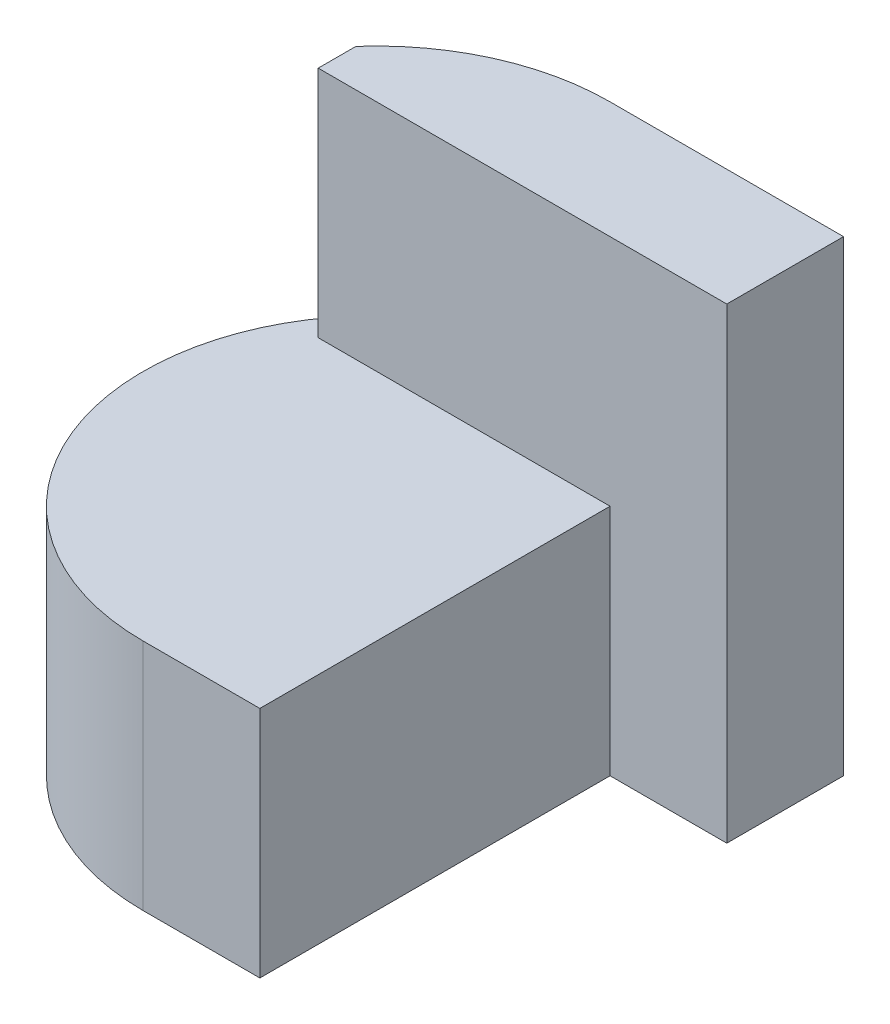
ISO-10303-21;
HEADER;
FILE_DESCRIPTION(('STEP AP214'),'2;1');
FILE_NAME('part.step','',(''),(''),'','','');
FILE_SCHEMA(('AUTOMOTIVE_DESIGN { 1 0 10303 214 1 1 1 1 }'));
ENDSEC;
DATA;
#1=APPLICATION_CONTEXT('core data for automotive mechanical design processes');
#2=APPLICATION_PROTOCOL_DEFINITION('international standard','automotive_design',2000,#1);
#3=PRODUCT_CONTEXT('',#1,'mechanical');
#4=PRODUCT('Part','Part','',(#3));
#5=PRODUCT_RELATED_PRODUCT_CATEGORY('part','',(#4));
#6=PRODUCT_DEFINITION_FORMATION('','',#4);
#7=PRODUCT_DEFINITION_CONTEXT('part definition',#1,'design');
#8=PRODUCT_DEFINITION('design','',#6,#7);
#9=PRODUCT_DEFINITION_SHAPE('','',#8);
#10=(LENGTH_UNIT() NAMED_UNIT(*) SI_UNIT(.MILLI.,.METRE.));
#11=(NAMED_UNIT(*) PLANE_ANGLE_UNIT() SI_UNIT($,.RADIAN.));
#12=(NAMED_UNIT(*) SI_UNIT($,.STERADIAN.) SOLID_ANGLE_UNIT());
#13=UNCERTAINTY_MEASURE_WITH_UNIT(LENGTH_MEASURE(1.E-05),#10,'distance_accuracy_value','');
#14=(GEOMETRIC_REPRESENTATION_CONTEXT(3) GLOBAL_UNCERTAINTY_ASSIGNED_CONTEXT((#13)) GLOBAL_UNIT_ASSIGNED_CONTEXT((#10,
#11,#12)) REPRESENTATION_CONTEXT('',''));
#15=CARTESIAN_POINT('',(0.,0.,0.));
#16=DIRECTION('',(0.,0.,1.));
#17=DIRECTION('',(1.,0.,0.));
#18=AXIS2_PLACEMENT_3D('',#15,#16,#17);
#19=CARTESIAN_POINT('',(0.,0.,40.));
#20=DIRECTION('',(0.,0.,-1.));
#21=DIRECTION('',(-1.,0.,0.));
#22=AXIS2_PLACEMENT_3D('',#19,#20,#21);
#23=PLANE('',#22);
#24=DIRECTION('',(0.,1.,0.));
#25=VECTOR('',#24,1.);
#26=CARTESIAN_POINT('',(30.,0.,40.));
#27=LINE('',#26,#25);
#28=CARTESIAN_POINT('',(30.,0.,40.));
#29=VERTEX_POINT('',#28);
#30=CARTESIAN_POINT('',(30.,20.,40.));
#31=VERTEX_POINT('',#30);
#32=EDGE_CURVE('E126',#29,#31,#27,.T.);
#33=ORIENTED_EDGE('',*,*,#32,.T.);
#34=DIRECTION('',(1.,0.,0.));
#35=VECTOR('',#34,1.);
#36=CARTESIAN_POINT('',(-10.,20.,40.));
#37=LINE('',#36,#35);
#38=CARTESIAN_POINT('',(20.,20.,40.));
#39=VERTEX_POINT('',#38);
#40=EDGE_CURVE('E114',#39,#31,#37,.T.);
#41=ORIENTED_EDGE('',*,*,#40,.F.);
#42=DIRECTION('',(0.,-1.,0.));
#43=VECTOR('',#42,1.);
#44=CARTESIAN_POINT('',(20.,40.,40.));
#45=LINE('',#44,#43);
#46=CARTESIAN_POINT('',(20.,0.,40.));
#47=VERTEX_POINT('',#46);
#48=EDGE_CURVE('E133',#39,#47,#45,.T.);
#49=ORIENTED_EDGE('',*,*,#48,.T.);
#50=DIRECTION('',(1.,0.,0.));
#51=VECTOR('',#50,1.);
#52=CARTESIAN_POINT('',(0.,0.,40.));
#53=LINE('',#52,#51);
#54=EDGE_CURVE('E132',#47,#29,#53,.T.);
#55=ORIENTED_EDGE('',*,*,#54,.T.);
#56=EDGE_LOOP('',(#33,#41,#49,#55));
#57=FACE_BOUND('',#56,.T.);
#58=ADVANCED_FACE('F51',(#57),#23,.F.);
#59=CARTESIAN_POINT('',(0.,0.,0.));
#60=DIRECTION('',(0.,0.,-1.));
#61=DIRECTION('',(-1.,0.,0.));
#62=AXIS2_PLACEMENT_3D('',#59,#60,#61);
#63=PLANE('',#62);
#64=DIRECTION('',(1.,0.,0.));
#65=VECTOR('',#64,1.);
#66=CARTESIAN_POINT('',(0.,0.,0.));
#67=LINE('',#66,#65);
#68=CARTESIAN_POINT('',(20.,0.,0.));
#69=VERTEX_POINT('',#68);
#70=CARTESIAN_POINT('',(40.,0.,0.));
#71=VERTEX_POINT('',#70);
#72=EDGE_CURVE('E158',#69,#71,#67,.T.);
#73=ORIENTED_EDGE('',*,*,#72,.F.);
#74=DIRECTION('',(0.,-1.,0.));
#75=VECTOR('',#74,1.);
#76=CARTESIAN_POINT('',(20.,40.,0.));
#77=LINE('',#76,#75);
#78=CARTESIAN_POINT('',(20.,40.,0.));
#79=VERTEX_POINT('',#78);
#80=EDGE_CURVE('E147',#79,#69,#77,.T.);
#81=ORIENTED_EDGE('',*,*,#80,.F.);
#82=DIRECTION('',(-1.,0.,0.));
#83=VECTOR('',#82,1.);
#84=CARTESIAN_POINT('',(0.,40.,0.));
#85=LINE('',#84,#83);
#86=CARTESIAN_POINT('',(40.,40.,0.));
#87=VERTEX_POINT('',#86);
#88=EDGE_CURVE('E163',#87,#79,#85,.T.);
#89=ORIENTED_EDGE('',*,*,#88,.F.);
#90=DIRECTION('',(0.,1.,0.));
#91=VECTOR('',#90,1.);
#92=CARTESIAN_POINT('',(40.,0.,0.));
#93=LINE('',#92,#91);
#94=EDGE_CURVE('E166',#71,#87,#93,.T.);
#95=ORIENTED_EDGE('',*,*,#94,.F.);
#96=EDGE_LOOP('',(#73,#81,#89,#95));
#97=FACE_BOUND('',#96,.T.);
#98=ADVANCED_FACE('F183',(#97),#63,.T.);
#99=CARTESIAN_POINT('',(0.,0.,40.));
#100=DIRECTION('',(0.,1.,0.));
#101=DIRECTION('',(0.,0.,1.));
#102=AXIS2_PLACEMENT_3D('',#99,#100,#101);
#103=PLANE('',#102);
#104=DIRECTION('',(-1.,0.,0.));
#105=VECTOR('',#104,1.);
#106=CARTESIAN_POINT('',(40.,0.,10.));
#107=LINE('',#106,#105);
#108=CARTESIAN_POINT('',(40.,0.,10.));
#109=VERTEX_POINT('',#108);
#110=CARTESIAN_POINT('',(30.,0.,10.));
#111=VERTEX_POINT('',#110);
#112=EDGE_CURVE('E188',#109,#111,#107,.T.);
#113=ORIENTED_EDGE('',*,*,#112,.T.);
#114=DIRECTION('',(0.,0.,1.));
#115=VECTOR('',#114,1.);
#116=CARTESIAN_POINT('',(30.,0.,40.));
#117=LINE('',#116,#115);
#118=EDGE_CURVE('E142',#111,#29,#117,.T.);
#119=ORIENTED_EDGE('',*,*,#118,.T.);
#120=ORIENTED_EDGE('',*,*,#54,.F.);
#121=CARTESIAN_POINT('',(20.,0.,20.));
#122=DIRECTION('',(0.,1.,0.));
#123=DIRECTION('',(0.,0.,1.));
#124=AXIS2_PLACEMENT_3D('',#121,#122,#123);
#125=CIRCLE('',#124,20.);
#126=EDGE_CURVE('E135',#69,#47,#125,.T.);
#127=ORIENTED_EDGE('',*,*,#126,.F.);
#128=ORIENTED_EDGE('',*,*,#72,.T.);
#129=DIRECTION('',(0.,0.,-1.));
#130=VECTOR('',#129,1.);
#131=CARTESIAN_POINT('',(40.,0.,40.));
#132=LINE('',#131,#130);
#133=EDGE_CURVE('E59',#109,#71,#132,.T.);
#134=ORIENTED_EDGE('',*,*,#133,.F.);
#135=EDGE_LOOP('',(#113,#119,#120,#127,#128,#134));
#136=FACE_BOUND('',#135,.T.);
#137=ADVANCED_FACE('F53',(#136),#103,.F.);
#138=CARTESIAN_POINT('',(40.,0.,40.));
#139=DIRECTION('',(-1.,0.,0.));
#140=DIRECTION('',(0.,0.,1.));
#141=AXIS2_PLACEMENT_3D('',#138,#139,#140);
#142=PLANE('',#141);
#143=DIRECTION('',(0.,0.,-1.));
#144=VECTOR('',#143,1.);
#145=CARTESIAN_POINT('',(40.,40.,40.));
#146=LINE('',#145,#144);
#147=CARTESIAN_POINT('',(40.,40.,10.));
#148=VERTEX_POINT('',#147);
#149=EDGE_CURVE('E162',#148,#87,#146,.T.);
#150=ORIENTED_EDGE('',*,*,#149,.F.);
#151=DIRECTION('',(0.,1.,0.));
#152=VECTOR('',#151,1.);
#153=CARTESIAN_POINT('',(40.,0.,10.));
#154=LINE('',#153,#152);
#155=EDGE_CURVE('E74',#109,#148,#154,.T.);
#156=ORIENTED_EDGE('',*,*,#155,.F.);
#157=ORIENTED_EDGE('',*,*,#133,.T.);
#158=ORIENTED_EDGE('',*,*,#94,.T.);
#159=EDGE_LOOP('',(#150,#156,#157,#158));
#160=FACE_BOUND('',#159,.T.);
#161=ADVANCED_FACE('F174',(#160),#142,.F.);
#162=CARTESIAN_POINT('',(0.,40.,40.));
#163=DIRECTION('',(0.,-1.,0.));
#164=DIRECTION('',(0.,0.,-1.));
#165=AXIS2_PLACEMENT_3D('',#162,#163,#164);
#166=PLANE('',#165);
#167=DIRECTION('',(0.,0.,1.));
#168=VECTOR('',#167,1.);
#169=CARTESIAN_POINT('',(5.,40.,0.));
#170=LINE('',#169,#168);
#171=CARTESIAN_POINT('',(5.,40.,6.77124344467705));
#172=VERTEX_POINT('',#171);
#173=CARTESIAN_POINT('',(5.,40.,10.));
#174=VERTEX_POINT('',#173);
#175=EDGE_CURVE('E155',#172,#174,#170,.T.);
#176=ORIENTED_EDGE('',*,*,#175,.T.);
#177=DIRECTION('',(-1.,0.,0.));
#178=VECTOR('',#177,1.);
#179=CARTESIAN_POINT('',(40.,40.,10.));
#180=LINE('',#179,#178);
#181=EDGE_CURVE('E139',#148,#174,#180,.T.);
#182=ORIENTED_EDGE('',*,*,#181,.F.);
#183=ORIENTED_EDGE('',*,*,#149,.T.);
#184=ORIENTED_EDGE('',*,*,#88,.T.);
#185=CARTESIAN_POINT('',(20.,40.,20.));
#186=DIRECTION('',(0.,1.,0.));
#187=DIRECTION('',(0.,0.,1.));
#188=AXIS2_PLACEMENT_3D('',#185,#186,#187);
#189=CIRCLE('',#188,20.);
#190=EDGE_CURVE('E144',#79,#172,#189,.T.);
#191=ORIENTED_EDGE('',*,*,#190,.T.);
#192=EDGE_LOOP('',(#176,#182,#183,#184,#191));
#193=FACE_BOUND('',#192,.T.);
#194=ADVANCED_FACE('F185',(#193),#166,.F.);
#195=CARTESIAN_POINT('',(5.,40.,0.));
#196=DIRECTION('',(1.,0.,0.));
#197=DIRECTION('',(0.,1.,0.));
#198=AXIS2_PLACEMENT_3D('',#195,#196,#197);
#199=PLANE('',#198);
#200=DIRECTION('',(0.,0.,1.));
#201=VECTOR('',#200,1.);
#202=CARTESIAN_POINT('',(5.,20.,0.));
#203=LINE('',#202,#201);
#204=CARTESIAN_POINT('',(5.,20.,6.77124344467705));
#205=VERTEX_POINT('',#204);
#206=CARTESIAN_POINT('',(5.,20.,10.));
#207=VERTEX_POINT('',#206);
#208=EDGE_CURVE('E154',#205,#207,#203,.T.);
#209=ORIENTED_EDGE('',*,*,#208,.T.);
#210=DIRECTION('',(0.,1.,0.));
#211=VECTOR('',#210,1.);
#212=CARTESIAN_POINT('',(5.,40.,10.));
#213=LINE('',#212,#211);
#214=EDGE_CURVE('E189',#207,#174,#213,.T.);
#215=ORIENTED_EDGE('',*,*,#214,.T.);
#216=ORIENTED_EDGE('',*,*,#175,.F.);
#217=DIRECTION('',(0.,-1.,0.));
#218=VECTOR('',#217,1.);
#219=CARTESIAN_POINT('',(5.,40.,6.77124344467705));
#220=LINE('',#219,#218);
#221=EDGE_CURVE('E151',#172,#205,#220,.T.);
#222=ORIENTED_EDGE('',*,*,#221,.T.);
#223=EDGE_LOOP('',(#209,#215,#216,#222));
#224=FACE_BOUND('',#223,.T.);
#225=ADVANCED_FACE('F195',(#224),#199,.F.);
#226=CARTESIAN_POINT('',(0.,20.,0.));
#227=DIRECTION('',(0.,-1.,0.));
#228=DIRECTION('',(0.,0.,-1.));
#229=AXIS2_PLACEMENT_3D('',#226,#227,#228);
#230=PLANE('',#229);
#231=CARTESIAN_POINT('',(20.,20.,20.));
#232=DIRECTION('',(0.,-1.,0.));
#233=DIRECTION('',(0.,0.,-1.));
#234=AXIS2_PLACEMENT_3D('',#231,#232,#233);
#235=CIRCLE('',#234,20.);
#236=EDGE_CURVE('E12',#205,#39,#235,.F.);
#237=ORIENTED_EDGE('',*,*,#236,.T.);
#238=ORIENTED_EDGE('',*,*,#40,.T.);
#239=DIRECTION('',(0.,0.,-1.));
#240=VECTOR('',#239,1.);
#241=CARTESIAN_POINT('',(30.,20.,40.));
#242=LINE('',#241,#240);
#243=CARTESIAN_POINT('',(30.,20.,10.));
#244=VERTEX_POINT('',#243);
#245=EDGE_CURVE('E66',#31,#244,#242,.T.);
#246=ORIENTED_EDGE('',*,*,#245,.T.);
#247=DIRECTION('',(1.,0.,0.));
#248=VECTOR('',#247,1.);
#249=CARTESIAN_POINT('',(-10.,20.,10.));
#250=LINE('',#249,#248);
#251=EDGE_CURVE('E120',#207,#244,#250,.T.);
#252=ORIENTED_EDGE('',*,*,#251,.F.);
#253=ORIENTED_EDGE('',*,*,#208,.F.);
#254=EDGE_LOOP('',(#237,#238,#246,#252,#253));
#255=FACE_BOUND('',#254,.T.);
#256=ADVANCED_FACE('F115',(#255),#230,.F.);
#257=CARTESIAN_POINT('',(20.,40.,20.));
#258=DIRECTION('',(0.,-1.,0.));
#259=DIRECTION('',(0.,0.,-1.));
#260=AXIS2_PLACEMENT_3D('',#257,#258,#259);
#261=CYLINDRICAL_SURFACE('',#260,20.);
#262=ORIENTED_EDGE('',*,*,#48,.F.);
#263=ORIENTED_EDGE('',*,*,#236,.F.);
#264=ORIENTED_EDGE('',*,*,#221,.F.);
#265=ORIENTED_EDGE('',*,*,#190,.F.);
#266=ORIENTED_EDGE('',*,*,#80,.T.);
#267=ORIENTED_EDGE('',*,*,#126,.T.);
#268=EDGE_LOOP('',(#262,#263,#264,#265,#266,#267));
#269=FACE_BOUND('',#268,.T.);
#270=ADVANCED_FACE('F197',(#269),#261,.T.);
#271=CARTESIAN_POINT('',(30.,0.,40.));
#272=DIRECTION('',(-1.,0.,0.));
#273=DIRECTION('',(0.,0.,1.));
#274=AXIS2_PLACEMENT_3D('',#271,#272,#273);
#275=PLANE('',#274);
#276=DIRECTION('',(0.,1.,0.));
#277=VECTOR('',#276,1.);
#278=CARTESIAN_POINT('',(30.,0.,10.));
#279=LINE('',#278,#277);
#280=EDGE_CURVE('E128',#111,#244,#279,.T.);
#281=ORIENTED_EDGE('',*,*,#280,.T.);
#282=ORIENTED_EDGE('',*,*,#245,.F.);
#283=ORIENTED_EDGE('',*,*,#32,.F.);
#284=ORIENTED_EDGE('',*,*,#118,.F.);
#285=EDGE_LOOP('',(#281,#282,#283,#284));
#286=FACE_BOUND('',#285,.T.);
#287=ADVANCED_FACE('F124',(#286),#275,.F.);
#288=CARTESIAN_POINT('',(40.,0.,10.));
#289=DIRECTION('',(0.,0.,-1.));
#290=DIRECTION('',(-1.,0.,0.));
#291=AXIS2_PLACEMENT_3D('',#288,#289,#290);
#292=PLANE('',#291);
#293=ORIENTED_EDGE('',*,*,#181,.T.);
#294=ORIENTED_EDGE('',*,*,#214,.F.);
#295=ORIENTED_EDGE('',*,*,#251,.T.);
#296=ORIENTED_EDGE('',*,*,#280,.F.);
#297=ORIENTED_EDGE('',*,*,#112,.F.);
#298=ORIENTED_EDGE('',*,*,#155,.T.);
#299=EDGE_LOOP('',(#293,#294,#295,#296,#297,#298));
#300=FACE_BOUND('',#299,.T.);
#301=ADVANCED_FACE('F194',(#300),#292,.F.);
#302=CLOSED_SHELL('',(#58,#98,#137,#161,#194,#225,#256,#270,#287,#301));
#303=MANIFOLD_SOLID_BREP('B2',#302);
#304=ADVANCED_BREP_SHAPE_REPRESENTATION('',(#18,#303),#14);
#305=SHAPE_DEFINITION_REPRESENTATION(#9,#304);
ENDSEC;
END-ISO-10303-21;
